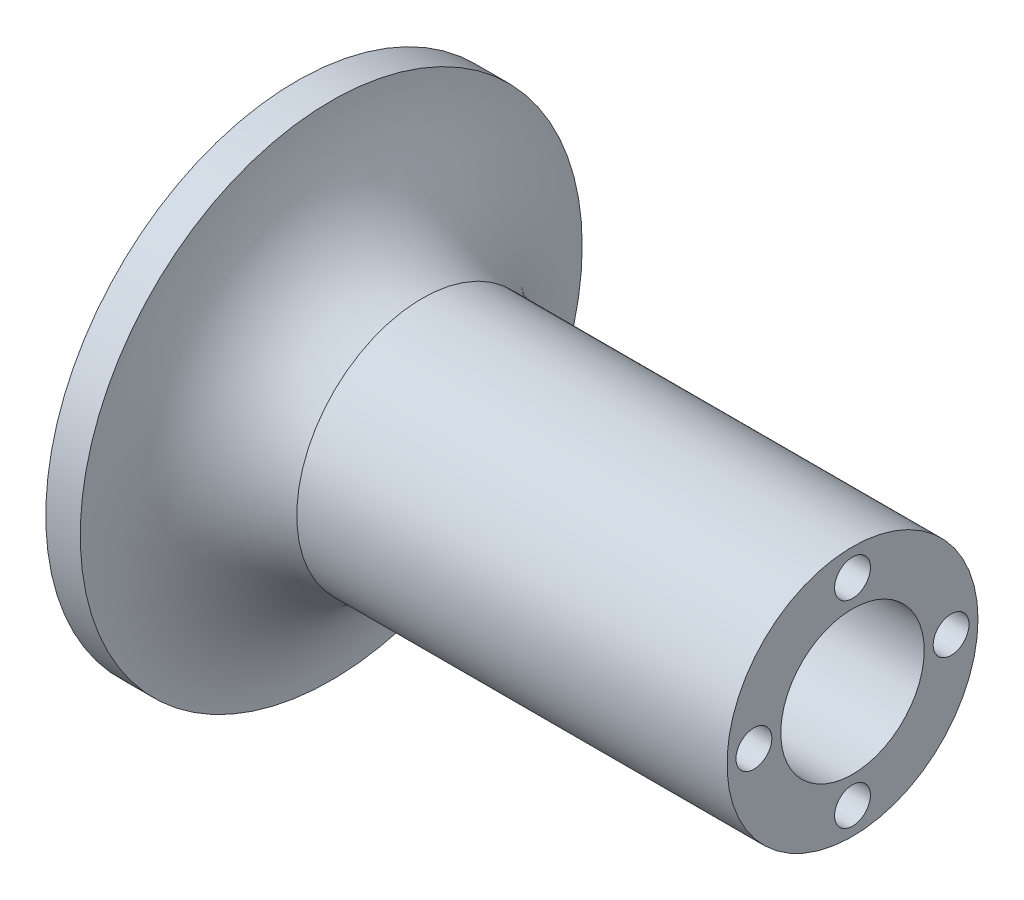
ISO-10303-21;
HEADER;
FILE_DESCRIPTION(('STEP AP214'),'2;1');
FILE_NAME('part.step','',(''),(''),'','','');
FILE_SCHEMA(('AUTOMOTIVE_DESIGN { 1 0 10303 214 1 1 1 1 }'));
ENDSEC;
DATA;
#1=APPLICATION_CONTEXT('core data for automotive mechanical design processes');
#2=APPLICATION_PROTOCOL_DEFINITION('international standard','automotive_design',2000,#1);
#3=PRODUCT_CONTEXT('',#1,'mechanical');
#4=PRODUCT('Part','Part','',(#3));
#5=PRODUCT_RELATED_PRODUCT_CATEGORY('part','',(#4));
#6=PRODUCT_DEFINITION_FORMATION('','',#4);
#7=PRODUCT_DEFINITION_CONTEXT('part definition',#1,'design');
#8=PRODUCT_DEFINITION('design','',#6,#7);
#9=PRODUCT_DEFINITION_SHAPE('','',#8);
#10=(LENGTH_UNIT() NAMED_UNIT(*) SI_UNIT(.MILLI.,.METRE.));
#11=(NAMED_UNIT(*) PLANE_ANGLE_UNIT() SI_UNIT($,.RADIAN.));
#12=(NAMED_UNIT(*) SI_UNIT($,.STERADIAN.) SOLID_ANGLE_UNIT());
#13=UNCERTAINTY_MEASURE_WITH_UNIT(LENGTH_MEASURE(1.E-05),#10,'distance_accuracy_value','');
#14=(GEOMETRIC_REPRESENTATION_CONTEXT(3) GLOBAL_UNCERTAINTY_ASSIGNED_CONTEXT((#13)) GLOBAL_UNIT_ASSIGNED_CONTEXT((#10,
#11,#12)) REPRESENTATION_CONTEXT('',''));
#15=CARTESIAN_POINT('',(0.,0.,0.));
#16=DIRECTION('',(0.,0.,1.));
#17=DIRECTION('',(1.,0.,0.));
#18=AXIS2_PLACEMENT_3D('',#15,#16,#17);
#19=CARTESIAN_POINT('',(60.9898891686574,0.,0.));
#20=DIRECTION('',(1.,0.,0.));
#21=DIRECTION('',(0.,0.,-1.));
#22=AXIS2_PLACEMENT_3D('',#19,#20,#21);
#23=PLANE('',#22);
#24=CARTESIAN_POINT('',(60.9898891686574,0.,-27.5));
#25=DIRECTION('',(1.,0.,0.));
#26=DIRECTION('',(0.,0.,-1.));
#27=AXIS2_PLACEMENT_3D('',#24,#25,#26);
#28=CIRCLE('',#27,5.);
#29=CARTESIAN_POINT('',(60.9898891686574,0.,-32.5));
#30=VERTEX_POINT('',#29);
#31=EDGE_CURVE('E74',#30,#30,#28,.T.);
#32=ORIENTED_EDGE('',*,*,#31,.F.);
#33=EDGE_LOOP('',(#32));
#34=FACE_BOUND('',#33,.T.);
#35=CARTESIAN_POINT('',(60.9898891686574,0.,27.5));
#36=DIRECTION('',(1.,0.,0.));
#37=DIRECTION('',(0.,0.,-1.));
#38=AXIS2_PLACEMENT_3D('',#35,#36,#37);
#39=CIRCLE('',#38,5.);
#40=CARTESIAN_POINT('',(60.9898891686574,0.,22.5));
#41=VERTEX_POINT('',#40);
#42=EDGE_CURVE('E68',#41,#41,#39,.T.);
#43=ORIENTED_EDGE('',*,*,#42,.F.);
#44=EDGE_LOOP('',(#43));
#45=FACE_BOUND('',#44,.T.);
#46=CARTESIAN_POINT('',(60.9898891686574,-27.5,0.));
#47=DIRECTION('',(1.,0.,0.));
#48=DIRECTION('',(0.,0.,-1.));
#49=AXIS2_PLACEMENT_3D('',#46,#47,#48);
#50=CIRCLE('',#49,5.);
#51=CARTESIAN_POINT('',(60.9898891686574,-27.5,-5.));
#52=VERTEX_POINT('',#51);
#53=EDGE_CURVE('E62',#52,#52,#50,.T.);
#54=ORIENTED_EDGE('',*,*,#53,.F.);
#55=EDGE_LOOP('',(#54));
#56=FACE_BOUND('',#55,.T.);
#57=CARTESIAN_POINT('',(60.9898891686574,27.5,0.));
#58=DIRECTION('',(1.,0.,0.));
#59=DIRECTION('',(0.,0.,-1.));
#60=AXIS2_PLACEMENT_3D('',#57,#58,#59);
#61=CIRCLE('',#60,5.);
#62=CARTESIAN_POINT('',(60.9898891686574,27.5,-5.));
#63=VERTEX_POINT('',#62);
#64=EDGE_CURVE('E56',#63,#63,#61,.T.);
#65=ORIENTED_EDGE('',*,*,#64,.F.);
#66=EDGE_LOOP('',(#65));
#67=FACE_BOUND('',#66,.T.);
#68=CARTESIAN_POINT('',(60.9898891686574,0.,0.));
#69=DIRECTION('',(1.,0.,0.));
#70=DIRECTION('',(0.,0.,-1.));
#71=AXIS2_PLACEMENT_3D('',#68,#69,#70);
#72=CIRCLE('',#71,20.);
#73=CARTESIAN_POINT('',(60.9898891686574,0.,-20.));
#74=VERTEX_POINT('',#73);
#75=EDGE_CURVE('E50',#74,#74,#72,.T.);
#76=ORIENTED_EDGE('',*,*,#75,.F.);
#77=EDGE_LOOP('',(#76));
#78=FACE_BOUND('',#77,.T.);
#79=CARTESIAN_POINT('',(60.9898891686574,0.,0.));
#80=DIRECTION('',(1.,0.,0.));
#81=DIRECTION('',(0.,0.,-1.));
#82=AXIS2_PLACEMENT_3D('',#79,#80,#81);
#83=CIRCLE('',#82,35.);
#84=CARTESIAN_POINT('',(60.9898891686574,0.,-35.));
#85=VERTEX_POINT('',#84);
#86=EDGE_CURVE('E10',#85,#85,#83,.T.);
#87=ORIENTED_EDGE('',*,*,#86,.T.);
#88=EDGE_LOOP('',(#87));
#89=FACE_BOUND('',#88,.T.);
#90=ADVANCED_FACE('F30',(#34,#45,#56,#67,#78,#89),#23,.T.);
#91=CARTESIAN_POINT('',(-67.0201174743026,0.,0.));
#92=DIRECTION('',(1.,0.,0.));
#93=DIRECTION('',(0.,0.,-1.));
#94=AXIS2_PLACEMENT_3D('',#91,#92,#93);
#95=CYLINDRICAL_SURFACE('',#94,35.);
#96=CARTESIAN_POINT('',(-59.0101108313426,0.,0.));
#97=DIRECTION('',(1.,0.,0.));
#98=DIRECTION('',(0.,0.,-1.));
#99=AXIS2_PLACEMENT_3D('',#96,#97,#98);
#100=CIRCLE('',#99,35.);
#101=CARTESIAN_POINT('',(-59.0101108313426,0.,-35.));
#102=VERTEX_POINT('',#101);
#103=EDGE_CURVE('E36',#102,#102,#100,.T.);
#104=ORIENTED_EDGE('',*,*,#103,.T.);
#105=EDGE_LOOP('',(#104));
#106=FACE_BOUND('',#105,.T.);
#107=ORIENTED_EDGE('',*,*,#86,.F.);
#108=EDGE_LOOP('',(#107));
#109=FACE_BOUND('',#108,.T.);
#110=ADVANCED_FACE('F91',(#106,#109),#95,.T.);
#111=CARTESIAN_POINT('',(-47.5695936338662,0.,0.));
#112=DIRECTION('',(1.,0.,0.));
#113=DIRECTION('',(0.,0.,-1.));
#114=AXIS2_PLACEMENT_3D('',#111,#112,#113);
#115=TOROIDAL_SURFACE('',#114,70.,36.822349649985);
#116=CARTESIAN_POINT('',(-84.3919432838513,0.,0.));
#117=DIRECTION('',(1.,0.,0.));
#118=DIRECTION('',(0.,0.,-1.));
#119=AXIS2_PLACEMENT_3D('',#116,#117,#118);
#120=CIRCLE('',#119,70.);
#121=CARTESIAN_POINT('',(-84.3919432838513,0.,-70.));
#122=VERTEX_POINT('',#121);
#123=EDGE_CURVE('E40',#122,#122,#120,.T.);
#124=ORIENTED_EDGE('',*,*,#123,.T.);
#125=EDGE_LOOP('',(#124));
#126=FACE_BOUND('',#125,.T.);
#127=ORIENTED_EDGE('',*,*,#103,.F.);
#128=EDGE_LOOP('',(#127));
#129=FACE_BOUND('',#128,.T.);
#130=ADVANCED_FACE('F121',(#126,#129),#115,.F.);
#131=CARTESIAN_POINT('',(-67.0201174743026,0.,0.));
#132=DIRECTION('',(1.,0.,0.));
#133=DIRECTION('',(0.,0.,-1.));
#134=AXIS2_PLACEMENT_3D('',#131,#132,#133);
#135=CYLINDRICAL_SURFACE('',#134,70.);
#136=CARTESIAN_POINT('',(-94.0101108313425,0.,0.));
#137=DIRECTION('',(1.,0.,0.));
#138=DIRECTION('',(0.,0.,-1.));
#139=AXIS2_PLACEMENT_3D('',#136,#137,#138);
#140=CIRCLE('',#139,70.);
#141=CARTESIAN_POINT('',(-94.0101108313425,0.,-70.));
#142=VERTEX_POINT('',#141);
#143=EDGE_CURVE('E44',#142,#142,#140,.T.);
#144=ORIENTED_EDGE('',*,*,#143,.T.);
#145=EDGE_LOOP('',(#144));
#146=FACE_BOUND('',#145,.T.);
#147=ORIENTED_EDGE('',*,*,#123,.F.);
#148=EDGE_LOOP('',(#147));
#149=FACE_BOUND('',#148,.T.);
#150=ADVANCED_FACE('F113',(#146,#149),#135,.T.);
#151=CARTESIAN_POINT('',(-94.0101108313425,70.,0.));
#152=DIRECTION('',(-1.,0.,0.));
#153=DIRECTION('',(0.,0.,1.));
#154=AXIS2_PLACEMENT_3D('',#151,#152,#153);
#155=PLANE('',#154);
#156=ORIENTED_EDGE('',*,*,#143,.F.);
#157=EDGE_LOOP('',(#156));
#158=FACE_BOUND('',#157,.T.);
#159=ADVANCED_FACE('F103',(#158),#155,.T.);
#160=CARTESIAN_POINT('',(-79.0101108313426,0.,0.));
#161=DIRECTION('',(1.,0.,0.));
#162=DIRECTION('',(0.,0.,-1.));
#163=AXIS2_PLACEMENT_3D('',#160,#161,#162);
#164=CYLINDRICAL_SURFACE('',#163,20.);
#165=CARTESIAN_POINT('',(-79.0101108313426,0.,0.));
#166=DIRECTION('',(1.,0.,0.));
#167=DIRECTION('',(0.,0.,-1.));
#168=AXIS2_PLACEMENT_3D('',#165,#166,#167);
#169=CIRCLE('',#168,20.);
#170=CARTESIAN_POINT('',(-79.0101108313426,0.,-20.));
#171=VERTEX_POINT('',#170);
#172=EDGE_CURVE('E49',#171,#171,#169,.T.);
#173=ORIENTED_EDGE('',*,*,#172,.F.);
#174=EDGE_LOOP('',(#173));
#175=FACE_BOUND('',#174,.T.);
#176=ORIENTED_EDGE('',*,*,#75,.T.);
#177=EDGE_LOOP('',(#176));
#178=FACE_BOUND('',#177,.T.);
#179=ADVANCED_FACE('F100',(#175,#178),#164,.F.);
#180=CARTESIAN_POINT('',(-79.0101108313426,0.,0.));
#181=DIRECTION('',(1.,0.,0.));
#182=DIRECTION('',(0.,0.,-1.));
#183=AXIS2_PLACEMENT_3D('',#180,#181,#182);
#184=PLANE('',#183);
#185=ORIENTED_EDGE('',*,*,#172,.T.);
#186=EDGE_LOOP('',(#185));
#187=FACE_BOUND('',#186,.T.);
#188=ADVANCED_FACE('F102',(#187),#184,.T.);
#189=CARTESIAN_POINT('',(40.9898891686574,27.5,0.));
#190=DIRECTION('',(1.,0.,0.));
#191=DIRECTION('',(0.,0.,-1.));
#192=AXIS2_PLACEMENT_3D('',#189,#190,#191);
#193=CYLINDRICAL_SURFACE('',#192,5.);
#194=CARTESIAN_POINT('',(40.9898891686574,27.5,0.));
#195=DIRECTION('',(1.,0.,0.));
#196=DIRECTION('',(0.,0.,-1.));
#197=AXIS2_PLACEMENT_3D('',#194,#195,#196);
#198=CIRCLE('',#197,5.);
#199=CARTESIAN_POINT('',(40.9898891686574,27.5,-5.));
#200=VERTEX_POINT('',#199);
#201=EDGE_CURVE('E53',#200,#200,#198,.T.);
#202=ORIENTED_EDGE('',*,*,#201,.F.);
#203=EDGE_LOOP('',(#202));
#204=FACE_BOUND('',#203,.T.);
#205=ORIENTED_EDGE('',*,*,#64,.T.);
#206=EDGE_LOOP('',(#205));
#207=FACE_BOUND('',#206,.T.);
#208=ADVANCED_FACE('F110',(#204,#207),#193,.F.);
#209=CARTESIAN_POINT('',(40.9898891686574,27.5,0.));
#210=DIRECTION('',(1.,0.,0.));
#211=DIRECTION('',(0.,0.,-1.));
#212=AXIS2_PLACEMENT_3D('',#209,#210,#211);
#213=PLANE('',#212);
#214=ORIENTED_EDGE('',*,*,#201,.T.);
#215=EDGE_LOOP('',(#214));
#216=FACE_BOUND('',#215,.T.);
#217=ADVANCED_FACE('F166',(#216),#213,.T.);
#218=CARTESIAN_POINT('',(40.9898891686574,-27.5,0.));
#219=DIRECTION('',(1.,0.,0.));
#220=DIRECTION('',(0.,0.,-1.));
#221=AXIS2_PLACEMENT_3D('',#218,#219,#220);
#222=CYLINDRICAL_SURFACE('',#221,5.);
#223=CARTESIAN_POINT('',(40.9898891686574,-27.5,0.));
#224=DIRECTION('',(1.,0.,0.));
#225=DIRECTION('',(0.,0.,-1.));
#226=AXIS2_PLACEMENT_3D('',#223,#224,#225);
#227=CIRCLE('',#226,5.);
#228=CARTESIAN_POINT('',(40.9898891686574,-27.5,-5.));
#229=VERTEX_POINT('',#228);
#230=EDGE_CURVE('E65',#229,#229,#227,.T.);
#231=ORIENTED_EDGE('',*,*,#230,.F.);
#232=EDGE_LOOP('',(#231));
#233=FACE_BOUND('',#232,.T.);
#234=ORIENTED_EDGE('',*,*,#53,.T.);
#235=EDGE_LOOP('',(#234));
#236=FACE_BOUND('',#235,.T.);
#237=ADVANCED_FACE('F175',(#233,#236),#222,.F.);
#238=CARTESIAN_POINT('',(40.9898891686574,-27.5,0.));
#239=DIRECTION('',(1.,0.,0.));
#240=DIRECTION('',(0.,0.,-1.));
#241=AXIS2_PLACEMENT_3D('',#238,#239,#240);
#242=PLANE('',#241);
#243=ORIENTED_EDGE('',*,*,#230,.T.);
#244=EDGE_LOOP('',(#243));
#245=FACE_BOUND('',#244,.T.);
#246=ADVANCED_FACE('F185',(#245),#242,.T.);
#247=CARTESIAN_POINT('',(40.9898891686574,0.,27.5));
#248=DIRECTION('',(1.,0.,0.));
#249=DIRECTION('',(0.,0.,-1.));
#250=AXIS2_PLACEMENT_3D('',#247,#248,#249);
#251=CYLINDRICAL_SURFACE('',#250,5.);
#252=CARTESIAN_POINT('',(40.9898891686574,0.,27.5));
#253=DIRECTION('',(1.,0.,0.));
#254=DIRECTION('',(0.,0.,-1.));
#255=AXIS2_PLACEMENT_3D('',#252,#253,#254);
#256=CIRCLE('',#255,5.);
#257=CARTESIAN_POINT('',(40.9898891686574,0.,22.5));
#258=VERTEX_POINT('',#257);
#259=EDGE_CURVE('E71',#258,#258,#256,.T.);
#260=ORIENTED_EDGE('',*,*,#259,.F.);
#261=EDGE_LOOP('',(#260));
#262=FACE_BOUND('',#261,.T.);
#263=ORIENTED_EDGE('',*,*,#42,.T.);
#264=EDGE_LOOP('',(#263));
#265=FACE_BOUND('',#264,.T.);
#266=ADVANCED_FACE('F195',(#262,#265),#251,.F.);
#267=CARTESIAN_POINT('',(40.9898891686574,0.,27.5));
#268=DIRECTION('',(1.,0.,0.));
#269=DIRECTION('',(0.,0.,-1.));
#270=AXIS2_PLACEMENT_3D('',#267,#268,#269);
#271=PLANE('',#270);
#272=ORIENTED_EDGE('',*,*,#259,.T.);
#273=EDGE_LOOP('',(#272));
#274=FACE_BOUND('',#273,.T.);
#275=ADVANCED_FACE('F85',(#274),#271,.T.);
#276=CARTESIAN_POINT('',(40.9898891686574,0.,-27.5));
#277=DIRECTION('',(1.,0.,0.));
#278=DIRECTION('',(0.,0.,-1.));
#279=AXIS2_PLACEMENT_3D('',#276,#277,#278);
#280=CYLINDRICAL_SURFACE('',#279,5.);
#281=CARTESIAN_POINT('',(40.9898891686574,0.,-27.5));
#282=DIRECTION('',(1.,0.,0.));
#283=DIRECTION('',(0.,0.,-1.));
#284=AXIS2_PLACEMENT_3D('',#281,#282,#283);
#285=CIRCLE('',#284,5.);
#286=CARTESIAN_POINT('',(40.9898891686574,0.,-32.5));
#287=VERTEX_POINT('',#286);
#288=EDGE_CURVE('E59',#287,#287,#285,.T.);
#289=ORIENTED_EDGE('',*,*,#288,.F.);
#290=EDGE_LOOP('',(#289));
#291=FACE_BOUND('',#290,.T.);
#292=ORIENTED_EDGE('',*,*,#31,.T.);
#293=EDGE_LOOP('',(#292));
#294=FACE_BOUND('',#293,.T.);
#295=ADVANCED_FACE('F82',(#291,#294),#280,.F.);
#296=CARTESIAN_POINT('',(40.9898891686574,0.,-27.5));
#297=DIRECTION('',(1.,0.,0.));
#298=DIRECTION('',(0.,0.,-1.));
#299=AXIS2_PLACEMENT_3D('',#296,#297,#298);
#300=PLANE('',#299);
#301=ORIENTED_EDGE('',*,*,#288,.T.);
#302=EDGE_LOOP('',(#301));
#303=FACE_BOUND('',#302,.T.);
#304=ADVANCED_FACE('F80',(#303),#300,.T.);
#305=CLOSED_SHELL('',(#90,#110,#130,#150,#159,#179,#188,#208,#217,#237,#246,#266,#275,#295,#304));
#306=MANIFOLD_SOLID_BREP('B2',#305);
#307=ADVANCED_BREP_SHAPE_REPRESENTATION('',(#18,#306),#14);
#308=SHAPE_DEFINITION_REPRESENTATION(#9,#307);
ENDSEC;
END-ISO-10303-21;
